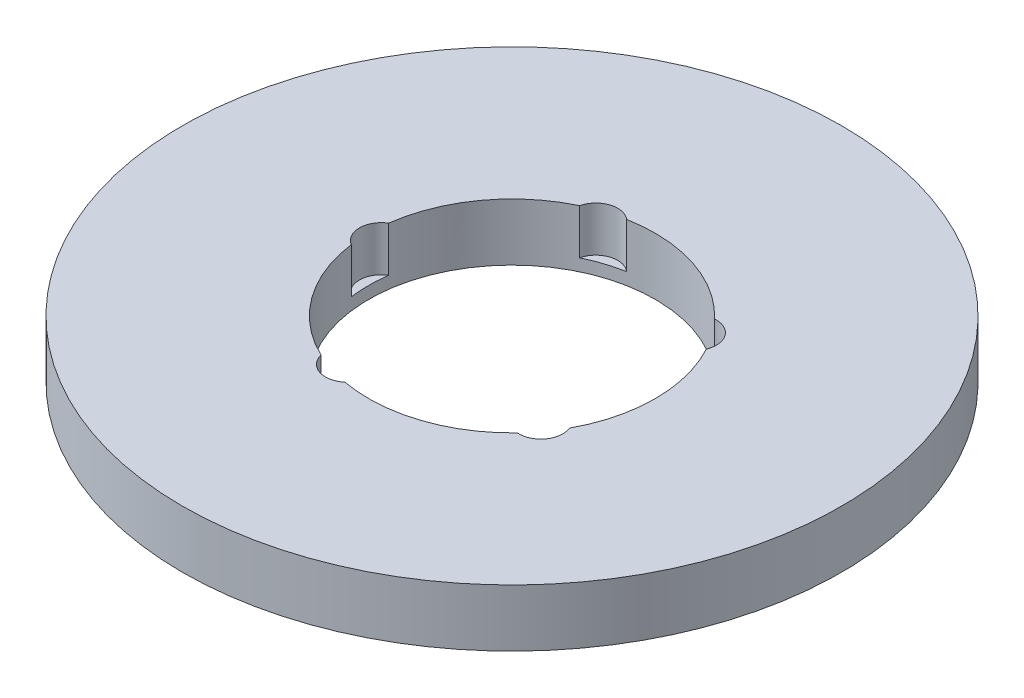
ISO-10303-21;
HEADER;
FILE_DESCRIPTION(('STEP AP214'),'2;1');
FILE_NAME('part.step','',(''),(''),'','','');
FILE_SCHEMA(('AUTOMOTIVE_DESIGN { 1 0 10303 214 1 1 1 1 }'));
ENDSEC;
DATA;
#1=APPLICATION_CONTEXT('core data for automotive mechanical design processes');
#2=APPLICATION_PROTOCOL_DEFINITION('international standard','automotive_design',2000,#1);
#3=PRODUCT_CONTEXT('',#1,'mechanical');
#4=PRODUCT('Part','Part','',(#3));
#5=PRODUCT_RELATED_PRODUCT_CATEGORY('part','',(#4));
#6=PRODUCT_DEFINITION_FORMATION('','',#4);
#7=PRODUCT_DEFINITION_CONTEXT('part definition',#1,'design');
#8=PRODUCT_DEFINITION('design','',#6,#7);
#9=PRODUCT_DEFINITION_SHAPE('','',#8);
#10=(LENGTH_UNIT() NAMED_UNIT(*) SI_UNIT(.MILLI.,.METRE.));
#11=(NAMED_UNIT(*) PLANE_ANGLE_UNIT() SI_UNIT($,.RADIAN.));
#12=(NAMED_UNIT(*) SI_UNIT($,.STERADIAN.) SOLID_ANGLE_UNIT());
#13=UNCERTAINTY_MEASURE_WITH_UNIT(LENGTH_MEASURE(1.E-05),#10,'distance_accuracy_value','');
#14=(GEOMETRIC_REPRESENTATION_CONTEXT(3) GLOBAL_UNCERTAINTY_ASSIGNED_CONTEXT((#13)) GLOBAL_UNIT_ASSIGNED_CONTEXT((#10,
#11,#12)) REPRESENTATION_CONTEXT('',''));
#15=CARTESIAN_POINT('',(0.,0.,0.));
#16=DIRECTION('',(0.,0.,1.));
#17=DIRECTION('',(1.,0.,0.));
#18=AXIS2_PLACEMENT_3D('',#15,#16,#17);
#19=CARTESIAN_POINT('',(0.,10.,0.));
#20=DIRECTION('',(0.,-1.,0.));
#21=DIRECTION('',(0.,0.,-1.));
#22=AXIS2_PLACEMENT_3D('',#19,#20,#21);
#23=CYLINDRICAL_SURFACE('',#22,57.5);
#24=CARTESIAN_POINT('',(0.,10.,0.));
#25=DIRECTION('',(0.,1.,0.));
#26=DIRECTION('',(0.,0.,1.));
#27=AXIS2_PLACEMENT_3D('',#24,#25,#26);
#28=CIRCLE('',#27,57.5);
#29=CARTESIAN_POINT('',(0.,10.,57.5));
#30=VERTEX_POINT('',#29);
#31=EDGE_CURVE('E159',#30,#30,#28,.T.);
#32=ORIENTED_EDGE('',*,*,#31,.F.);
#33=EDGE_LOOP('',(#32));
#34=FACE_BOUND('',#33,.T.);
#35=CARTESIAN_POINT('',(0.,0.,0.));
#36=DIRECTION('',(0.,1.,0.));
#37=DIRECTION('',(0.,0.,1.));
#38=AXIS2_PLACEMENT_3D('',#35,#36,#37);
#39=CIRCLE('',#38,57.5);
#40=CARTESIAN_POINT('',(0.,0.,57.5));
#41=VERTEX_POINT('',#40);
#42=EDGE_CURVE('E152',#41,#41,#39,.T.);
#43=ORIENTED_EDGE('',*,*,#42,.T.);
#44=EDGE_LOOP('',(#43));
#45=FACE_BOUND('',#44,.T.);
#46=ADVANCED_FACE('F39',(#34,#45),#23,.T.);
#47=CARTESIAN_POINT('',(0.,10.,0.));
#48=DIRECTION('',(0.,1.,0.));
#49=DIRECTION('',(0.,0.,1.));
#50=AXIS2_PLACEMENT_3D('',#47,#48,#49);
#51=PLANE('',#50);
#52=CARTESIAN_POINT('',(-7.04628501653784,10.,21.6862353936434));
#53=DIRECTION('',(0.,1.,0.));
#54=DIRECTION('',(0.951056516295155,0.,0.309016994374945));
#55=AXIS2_PLACEMENT_3D('',#52,#53,#54);
#56=CIRCLE('',#55,3.80872134641238);
#57=CARTESIAN_POINT('',(-10.7509955307374,10.,22.5702480070128));
#58=VERTEX_POINT('',#57);
#59=CARTESIAN_POINT('',(-4.56872082828985,10.,24.5789908253604));
#60=VERTEX_POINT('',#59);
#61=EDGE_CURVE('E192',#58,#60,#56,.T.);
#62=ORIENTED_EDGE('',*,*,#61,.F.);
#63=CARTESIAN_POINT('',(0.,10.,0.));
#64=DIRECTION('',(0.,1.,0.));
#65=DIRECTION('',(0.,0.,1.));
#66=AXIS2_PLACEMENT_3D('',#63,#64,#65);
#67=CIRCLE('',#66,25.);
#68=CARTESIAN_POINT('',(-24.7878217669142,10.,3.25021415474375));
#69=VERTEX_POINT('',#68);
#70=EDGE_CURVE('E147',#69,#58,#67,.T.);
#71=ORIENTED_EDGE('',*,*,#70,.F.);
#72=CARTESIAN_POINT('',(-22.8022573023549,10.,0.));
#73=DIRECTION('',(0.,1.,0.));
#74=DIRECTION('',(0.,0.,1.));
#75=AXIS2_PLACEMENT_3D('',#72,#73,#74);
#76=CIRCLE('',#75,3.80872134641238);
#77=CARTESIAN_POINT('',(-24.7878217669142,10.,-3.25021415474375));
#78=VERTEX_POINT('',#77);
#79=EDGE_CURVE('E154',#78,#69,#76,.T.);
#80=ORIENTED_EDGE('',*,*,#79,.F.);
#81=CARTESIAN_POINT('',(-10.7509955307378,10.,-22.5702480070126));
#82=VERTEX_POINT('',#81);
#83=EDGE_CURVE('E136',#82,#78,#67,.T.);
#84=ORIENTED_EDGE('',*,*,#83,.F.);
#85=CARTESIAN_POINT('',(-7.04628501653814,10.,-21.6862353936433));
#86=DIRECTION('',(0.,1.,0.));
#87=DIRECTION('',(-0.95105651629515,0.,0.309016994374958));
#88=AXIS2_PLACEMENT_3D('',#85,#86,#87);
#89=CIRCLE('',#88,3.80872134641238);
#90=CARTESIAN_POINT('',(-4.5687208282902,10.,-24.5789908253603));
#91=VERTEX_POINT('',#90);
#92=EDGE_CURVE('E117',#91,#82,#89,.T.);
#93=ORIENTED_EDGE('',*,*,#92,.F.);
#94=CARTESIAN_POINT('',(18.14334111602,10.,-17.1993945575924));
#95=VERTEX_POINT('',#94);
#96=EDGE_CURVE('E133',#95,#91,#67,.T.);
#97=ORIENTED_EDGE('',*,*,#96,.F.);
#98=CARTESIAN_POINT('',(18.4474136677152,10.,-13.4028305613027));
#99=DIRECTION('',(0.,1.,0.));
#100=DIRECTION('',(-0.58778525229248,0.,-0.809016994374942));
#101=AXIS2_PLACEMENT_3D('',#98,#99,#100);
#102=CIRCLE('',#101,3.80872134641238);
#103=CARTESIAN_POINT('',(21.9641970099213,10.,-11.940437584501));
#104=VERTEX_POINT('',#103);
#105=EDGE_CURVE('E333',#104,#95,#102,.T.);
#106=ORIENTED_EDGE('',*,*,#105,.F.);
#107=CARTESIAN_POINT('',(21.9641970099215,10.,11.9404375845007));
#108=VERTEX_POINT('',#107);
#109=EDGE_CURVE('E144',#108,#104,#67,.T.);
#110=ORIENTED_EDGE('',*,*,#109,.F.);
#111=CARTESIAN_POINT('',(18.4474136677154,10.,13.4028305613024));
#112=DIRECTION('',(0.,1.,0.));
#113=DIRECTION('',(0.587785252292469,0.,-0.809016994374951));
#114=AXIS2_PLACEMENT_3D('',#111,#112,#113);
#115=CIRCLE('',#114,3.80872134641238);
#116=CARTESIAN_POINT('',(18.1433411160203,10.,17.1993945575921));
#117=VERTEX_POINT('',#116);
#118=EDGE_CURVE('E328',#117,#108,#115,.T.);
#119=ORIENTED_EDGE('',*,*,#118,.F.);
#120=EDGE_CURVE('E146',#60,#117,#67,.T.);
#121=ORIENTED_EDGE('',*,*,#120,.F.);
#122=EDGE_LOOP('',(#62,#71,#80,#84,#93,#97,#106,#110,#119,#121));
#123=FACE_BOUND('',#122,.T.);
#124=ORIENTED_EDGE('',*,*,#31,.T.);
#125=EDGE_LOOP('',(#124));
#126=FACE_BOUND('',#125,.T.);
#127=ADVANCED_FACE('F131',(#123,#126),#51,.T.);
#128=CARTESIAN_POINT('',(0.,0.,0.));
#129=DIRECTION('',(0.,1.,0.));
#130=DIRECTION('',(0.,0.,1.));
#131=AXIS2_PLACEMENT_3D('',#128,#129,#130);
#132=PLANE('',#131);
#133=CARTESIAN_POINT('',(0.,0.,0.));
#134=DIRECTION('',(0.,1.,0.));
#135=DIRECTION('',(0.,0.,1.));
#136=AXIS2_PLACEMENT_3D('',#133,#134,#135);
#137=CIRCLE('',#136,25.);
#138=CARTESIAN_POINT('',(0.,0.,25.));
#139=VERTEX_POINT('',#138);
#140=EDGE_CURVE('E149',#139,#139,#137,.T.);
#141=ORIENTED_EDGE('',*,*,#140,.T.);
#142=EDGE_LOOP('',(#141));
#143=FACE_BOUND('',#142,.T.);
#144=ORIENTED_EDGE('',*,*,#42,.F.);
#145=EDGE_LOOP('',(#144));
#146=FACE_BOUND('',#145,.T.);
#147=ADVANCED_FACE('F209',(#143,#146),#132,.F.);
#148=CARTESIAN_POINT('',(0.,10.,0.));
#149=DIRECTION('',(0.,-1.,0.));
#150=DIRECTION('',(0.,0.,-1.));
#151=AXIS2_PLACEMENT_3D('',#148,#149,#150);
#152=CYLINDRICAL_SURFACE('',#151,25.);
#153=DIRECTION('',(0.,1.,0.));
#154=VECTOR('',#153,1.);
#155=CARTESIAN_POINT('',(-10.7509955307374,6.06036747666711,22.5702480070128));
#156=LINE('',#155,#154);
#157=CARTESIAN_POINT('',(-10.7509955307374,2.12073495333421,22.5702480070128));
#158=VERTEX_POINT('',#157);
#159=EDGE_CURVE('E11',#158,#58,#156,.T.);
#160=ORIENTED_EDGE('',*,*,#159,.F.);
#161=CARTESIAN_POINT('',(0.,2.12073495333421,0.));
#162=DIRECTION('',(0.,1.,0.));
#163=DIRECTION('',(0.,0.,1.));
#164=AXIS2_PLACEMENT_3D('',#161,#162,#163);
#165=CIRCLE('',#164,25.);
#166=CARTESIAN_POINT('',(-4.56872082828985,2.12073495333421,24.5789908253604));
#167=VERTEX_POINT('',#166);
#168=EDGE_CURVE('E187',#158,#167,#165,.T.);
#169=ORIENTED_EDGE('',*,*,#168,.T.);
#170=DIRECTION('',(0.,1.,0.));
#171=VECTOR('',#170,1.);
#172=CARTESIAN_POINT('',(-4.56872082828984,6.06036747666711,24.5789908253604));
#173=LINE('',#172,#171);
#174=EDGE_CURVE('E46',#60,#167,#173,.F.);
#175=ORIENTED_EDGE('',*,*,#174,.F.);
#176=ORIENTED_EDGE('',*,*,#120,.T.);
#177=DIRECTION('',(0.,1.,0.));
#178=VECTOR('',#177,1.);
#179=CARTESIAN_POINT('',(18.1433411160203,6.06036747666711,17.1993945575921));
#180=LINE('',#179,#178);
#181=CARTESIAN_POINT('',(18.1433411160203,2.12073495333421,17.1993945575921));
#182=VERTEX_POINT('',#181);
#183=EDGE_CURVE('E186',#182,#117,#180,.T.);
#184=ORIENTED_EDGE('',*,*,#183,.F.);
#185=CARTESIAN_POINT('',(0.,2.12073495333421,0.));
#186=DIRECTION('',(0.,1.,0.));
#187=DIRECTION('',(0.,0.,1.));
#188=AXIS2_PLACEMENT_3D('',#185,#186,#187);
#189=CIRCLE('',#188,25.);
#190=CARTESIAN_POINT('',(21.9641970099215,2.12073495333421,11.9404375845007));
#191=VERTEX_POINT('',#190);
#192=EDGE_CURVE('E182',#182,#191,#189,.T.);
#193=ORIENTED_EDGE('',*,*,#192,.T.);
#194=DIRECTION('',(0.,1.,0.));
#195=VECTOR('',#194,1.);
#196=CARTESIAN_POINT('',(21.9641970099215,6.06036747666711,11.9404375845007));
#197=LINE('',#196,#195);
#198=EDGE_CURVE('E184',#108,#191,#197,.F.);
#199=ORIENTED_EDGE('',*,*,#198,.F.);
#200=ORIENTED_EDGE('',*,*,#109,.T.);
#201=DIRECTION('',(0.,1.,0.));
#202=VECTOR('',#201,1.);
#203=CARTESIAN_POINT('',(21.9641970099213,6.06036747666711,-11.940437584501));
#204=LINE('',#203,#202);
#205=CARTESIAN_POINT('',(21.9641970099213,2.12073495333421,-11.940437584501));
#206=VERTEX_POINT('',#205);
#207=EDGE_CURVE('E178',#206,#104,#204,.T.);
#208=ORIENTED_EDGE('',*,*,#207,.F.);
#209=CARTESIAN_POINT('',(0.,2.12073495333421,0.));
#210=DIRECTION('',(0.,1.,0.));
#211=DIRECTION('',(0.,0.,1.));
#212=AXIS2_PLACEMENT_3D('',#209,#210,#211);
#213=CIRCLE('',#212,25.);
#214=CARTESIAN_POINT('',(18.14334111602,2.12073495333421,-17.1993945575924));
#215=VERTEX_POINT('',#214);
#216=EDGE_CURVE('E123',#206,#215,#213,.T.);
#217=ORIENTED_EDGE('',*,*,#216,.T.);
#218=DIRECTION('',(0.,1.,0.));
#219=VECTOR('',#218,1.);
#220=CARTESIAN_POINT('',(18.14334111602,6.06036747666711,-17.1993945575924));
#221=LINE('',#220,#219);
#222=EDGE_CURVE('E145',#95,#215,#221,.F.);
#223=ORIENTED_EDGE('',*,*,#222,.F.);
#224=ORIENTED_EDGE('',*,*,#96,.T.);
#225=DIRECTION('',(0.,1.,0.));
#226=VECTOR('',#225,1.);
#227=CARTESIAN_POINT('',(-4.5687208282902,6.06036747666711,-24.5789908253603));
#228=LINE('',#227,#226);
#229=CARTESIAN_POINT('',(-4.5687208282902,2.12073495333421,-24.5789908253603));
#230=VERTEX_POINT('',#229);
#231=EDGE_CURVE('E111',#230,#91,#228,.T.);
#232=ORIENTED_EDGE('',*,*,#231,.F.);
#233=CARTESIAN_POINT('',(0.,2.12073495333421,0.));
#234=DIRECTION('',(0.,1.,0.));
#235=DIRECTION('',(0.,0.,1.));
#236=AXIS2_PLACEMENT_3D('',#233,#234,#235);
#237=CIRCLE('',#236,25.);
#238=CARTESIAN_POINT('',(-10.7509955307378,2.12073495333421,-22.5702480070126));
#239=VERTEX_POINT('',#238);
#240=EDGE_CURVE('E173',#230,#239,#237,.T.);
#241=ORIENTED_EDGE('',*,*,#240,.T.);
#242=DIRECTION('',(0.,1.,0.));
#243=VECTOR('',#242,1.);
#244=CARTESIAN_POINT('',(-10.7509955307378,6.06036747666711,-22.5702480070126));
#245=LINE('',#244,#243);
#246=EDGE_CURVE('E124',#82,#239,#245,.F.);
#247=ORIENTED_EDGE('',*,*,#246,.F.);
#248=ORIENTED_EDGE('',*,*,#83,.T.);
#249=DIRECTION('',(0.,1.,0.));
#250=VECTOR('',#249,1.);
#251=CARTESIAN_POINT('',(-24.7878217669142,6.06036747666711,-3.25021415474376));
#252=LINE('',#251,#250);
#253=CARTESIAN_POINT('',(-24.7878217669142,2.12073495333421,-3.25021415474375));
#254=VERTEX_POINT('',#253);
#255=EDGE_CURVE('E171',#254,#78,#252,.T.);
#256=ORIENTED_EDGE('',*,*,#255,.F.);
#257=CARTESIAN_POINT('',(0.,2.12073495333421,0.));
#258=DIRECTION('',(0.,1.,0.));
#259=DIRECTION('',(0.,0.,1.));
#260=AXIS2_PLACEMENT_3D('',#257,#258,#259);
#261=CIRCLE('',#260,25.);
#262=CARTESIAN_POINT('',(-24.7878217669142,2.12073495333421,3.25021415474375));
#263=VERTEX_POINT('',#262);
#264=EDGE_CURVE('E162',#254,#263,#261,.T.);
#265=ORIENTED_EDGE('',*,*,#264,.T.);
#266=DIRECTION('',(0.,1.,0.));
#267=VECTOR('',#266,1.);
#268=CARTESIAN_POINT('',(-24.7878217669142,6.06036747666711,3.25021415474376));
#269=LINE('',#268,#267);
#270=EDGE_CURVE('E169',#69,#263,#269,.F.);
#271=ORIENTED_EDGE('',*,*,#270,.F.);
#272=ORIENTED_EDGE('',*,*,#70,.T.);
#273=EDGE_LOOP('',(#160,#169,#175,#176,#184,#193,#199,#200,#208,#217,#223,#224,#232,#241,#247,
#248,#256,#265,#271,#272));
#274=FACE_BOUND('',#273,.T.);
#275=ORIENTED_EDGE('',*,*,#140,.F.);
#276=EDGE_LOOP('',(#275));
#277=FACE_BOUND('',#276,.T.);
#278=ADVANCED_FACE('F139',(#274,#277),#152,.F.);
#279=CARTESIAN_POINT('',(-22.8022573023549,2.12073495333421,0.));
#280=DIRECTION('',(0.,1.,0.));
#281=DIRECTION('',(0.,0.,1.));
#282=AXIS2_PLACEMENT_3D('',#279,#280,#281);
#283=CYLINDRICAL_SURFACE('',#282,3.80872134641238);
#284=ORIENTED_EDGE('',*,*,#255,.T.);
#285=ORIENTED_EDGE('',*,*,#79,.T.);
#286=ORIENTED_EDGE('',*,*,#270,.T.);
#287=CARTESIAN_POINT('',(-22.8022573023549,2.12073495333421,0.));
#288=DIRECTION('',(0.,1.,0.));
#289=DIRECTION('',(0.,0.,1.));
#290=AXIS2_PLACEMENT_3D('',#287,#288,#289);
#291=CIRCLE('',#290,3.80872134641238);
#292=EDGE_CURVE('E157',#254,#263,#291,.T.);
#293=ORIENTED_EDGE('',*,*,#292,.F.);
#294=EDGE_LOOP('',(#284,#285,#286,#293));
#295=FACE_BOUND('',#294,.T.);
#296=ADVANCED_FACE('F222',(#295),#283,.F.);
#297=CARTESIAN_POINT('',(-22.8022573023549,2.12073495333421,0.));
#298=DIRECTION('',(0.,1.,0.));
#299=DIRECTION('',(0.,0.,1.));
#300=AXIS2_PLACEMENT_3D('',#297,#298,#299);
#301=PLANE('',#300);
#302=ORIENTED_EDGE('',*,*,#292,.T.);
#303=ORIENTED_EDGE('',*,*,#264,.F.);
#304=EDGE_LOOP('',(#302,#303));
#305=FACE_BOUND('',#304,.T.);
#306=ADVANCED_FACE('F223',(#305),#301,.T.);
#307=CARTESIAN_POINT('',(-7.04628501653814,2.12073495333421,-21.6862353936433));
#308=DIRECTION('',(0.,1.,0.));
#309=DIRECTION('',(0.,0.,1.));
#310=AXIS2_PLACEMENT_3D('',#307,#308,#309);
#311=CYLINDRICAL_SURFACE('',#310,3.80872134641238);
#312=ORIENTED_EDGE('',*,*,#231,.T.);
#313=ORIENTED_EDGE('',*,*,#92,.T.);
#314=ORIENTED_EDGE('',*,*,#246,.T.);
#315=CARTESIAN_POINT('',(-7.04628501653814,2.12073495333421,-21.6862353936433));
#316=DIRECTION('',(0.,1.,0.));
#317=DIRECTION('',(-0.95105651629515,0.,0.309016994374958));
#318=AXIS2_PLACEMENT_3D('',#315,#316,#317);
#319=CIRCLE('',#318,3.80872134641238);
#320=EDGE_CURVE('E119',#230,#239,#319,.T.);
#321=ORIENTED_EDGE('',*,*,#320,.F.);
#322=EDGE_LOOP('',(#312,#313,#314,#321));
#323=FACE_BOUND('',#322,.T.);
#324=ADVANCED_FACE('F116',(#323),#311,.F.);
#325=CARTESIAN_POINT('',(-7.04628501653814,2.12073495333421,-21.6862353936433));
#326=DIRECTION('',(0.,1.,0.));
#327=DIRECTION('',(-0.95105651629515,0.,0.309016994374958));
#328=AXIS2_PLACEMENT_3D('',#325,#326,#327);
#329=PLANE('',#328);
#330=ORIENTED_EDGE('',*,*,#320,.T.);
#331=ORIENTED_EDGE('',*,*,#240,.F.);
#332=EDGE_LOOP('',(#330,#331));
#333=FACE_BOUND('',#332,.T.);
#334=ADVANCED_FACE('F235',(#333),#329,.T.);
#335=CARTESIAN_POINT('',(18.4474136677152,2.12073495333421,-13.4028305613027));
#336=DIRECTION('',(0.,1.,0.));
#337=DIRECTION('',(0.,0.,1.));
#338=AXIS2_PLACEMENT_3D('',#335,#336,#337);
#339=CYLINDRICAL_SURFACE('',#338,3.80872134641238);
#340=ORIENTED_EDGE('',*,*,#207,.T.);
#341=ORIENTED_EDGE('',*,*,#105,.T.);
#342=ORIENTED_EDGE('',*,*,#222,.T.);
#343=CARTESIAN_POINT('',(18.4474136677152,2.12073495333421,-13.4028305613027));
#344=DIRECTION('',(0.,1.,0.));
#345=DIRECTION('',(-0.58778525229248,0.,-0.809016994374942));
#346=AXIS2_PLACEMENT_3D('',#343,#344,#345);
#347=CIRCLE('',#346,3.80872134641238);
#348=EDGE_CURVE('E335',#206,#215,#347,.T.);
#349=ORIENTED_EDGE('',*,*,#348,.F.);
#350=EDGE_LOOP('',(#340,#341,#342,#349));
#351=FACE_BOUND('',#350,.T.);
#352=ADVANCED_FACE('F234',(#351),#339,.F.);
#353=CARTESIAN_POINT('',(18.4474136677152,2.12073495333421,-13.4028305613027));
#354=DIRECTION('',(0.,1.,0.));
#355=DIRECTION('',(-0.58778525229248,0.,-0.809016994374942));
#356=AXIS2_PLACEMENT_3D('',#353,#354,#355);
#357=PLANE('',#356);
#358=ORIENTED_EDGE('',*,*,#348,.T.);
#359=ORIENTED_EDGE('',*,*,#216,.F.);
#360=EDGE_LOOP('',(#358,#359));
#361=FACE_BOUND('',#360,.T.);
#362=ADVANCED_FACE('F239',(#361),#357,.T.);
#363=CARTESIAN_POINT('',(18.4474136677154,2.12073495333421,13.4028305613024));
#364=DIRECTION('',(0.,1.,0.));
#365=DIRECTION('',(0.,0.,1.));
#366=AXIS2_PLACEMENT_3D('',#363,#364,#365);
#367=CYLINDRICAL_SURFACE('',#366,3.80872134641238);
#368=ORIENTED_EDGE('',*,*,#183,.T.);
#369=ORIENTED_EDGE('',*,*,#118,.T.);
#370=ORIENTED_EDGE('',*,*,#198,.T.);
#371=CARTESIAN_POINT('',(18.4474136677154,2.12073495333421,13.4028305613024));
#372=DIRECTION('',(0.,1.,0.));
#373=DIRECTION('',(0.587785252292469,0.,-0.809016994374951));
#374=AXIS2_PLACEMENT_3D('',#371,#372,#373);
#375=CIRCLE('',#374,3.80872134641238);
#376=EDGE_CURVE('E56',#182,#191,#375,.T.);
#377=ORIENTED_EDGE('',*,*,#376,.F.);
#378=EDGE_LOOP('',(#368,#369,#370,#377));
#379=FACE_BOUND('',#378,.T.);
#380=ADVANCED_FACE('F242',(#379),#367,.F.);
#381=CARTESIAN_POINT('',(18.4474136677154,2.12073495333421,13.4028305613024));
#382=DIRECTION('',(0.,1.,0.));
#383=DIRECTION('',(0.587785252292469,0.,-0.809016994374951));
#384=AXIS2_PLACEMENT_3D('',#381,#382,#383);
#385=PLANE('',#384);
#386=ORIENTED_EDGE('',*,*,#376,.T.);
#387=ORIENTED_EDGE('',*,*,#192,.F.);
#388=EDGE_LOOP('',(#386,#387));
#389=FACE_BOUND('',#388,.T.);
#390=ADVANCED_FACE('F205',(#389),#385,.T.);
#391=CARTESIAN_POINT('',(-7.04628501653784,2.12073495333421,21.6862353936434));
#392=DIRECTION('',(0.,1.,0.));
#393=DIRECTION('',(0.,0.,1.));
#394=AXIS2_PLACEMENT_3D('',#391,#392,#393);
#395=CYLINDRICAL_SURFACE('',#394,3.80872134641238);
#396=ORIENTED_EDGE('',*,*,#159,.T.);
#397=ORIENTED_EDGE('',*,*,#61,.T.);
#398=ORIENTED_EDGE('',*,*,#174,.T.);
#399=CARTESIAN_POINT('',(-7.04628501653784,2.12073495333421,21.6862353936434));
#400=DIRECTION('',(0.,1.,0.));
#401=DIRECTION('',(0.951056516295155,0.,0.309016994374945));
#402=AXIS2_PLACEMENT_3D('',#399,#400,#401);
#403=CIRCLE('',#402,3.80872134641238);
#404=EDGE_CURVE('E55',#158,#167,#403,.T.);
#405=ORIENTED_EDGE('',*,*,#404,.F.);
#406=EDGE_LOOP('',(#396,#397,#398,#405));
#407=FACE_BOUND('',#406,.T.);
#408=ADVANCED_FACE('F195',(#407),#395,.F.);
#409=CARTESIAN_POINT('',(-7.04628501653784,2.12073495333421,21.6862353936434));
#410=DIRECTION('',(0.,1.,0.));
#411=DIRECTION('',(0.951056516295155,0.,0.309016994374945));
#412=AXIS2_PLACEMENT_3D('',#409,#410,#411);
#413=PLANE('',#412);
#414=ORIENTED_EDGE('',*,*,#404,.T.);
#415=ORIENTED_EDGE('',*,*,#168,.F.);
#416=EDGE_LOOP('',(#414,#415));
#417=FACE_BOUND('',#416,.T.);
#418=ADVANCED_FACE('F198',(#417),#413,.T.);
#419=CLOSED_SHELL('',(#46,#127,#147,#278,#296,#306,#324,#334,#352,#362,#380,#390,#408,#418));
#420=MANIFOLD_SOLID_BREP('B2',#419);
#421=ADVANCED_BREP_SHAPE_REPRESENTATION('',(#18,#420),#14);
#422=SHAPE_DEFINITION_REPRESENTATION(#9,#421);
ENDSEC;
END-ISO-10303-21;
